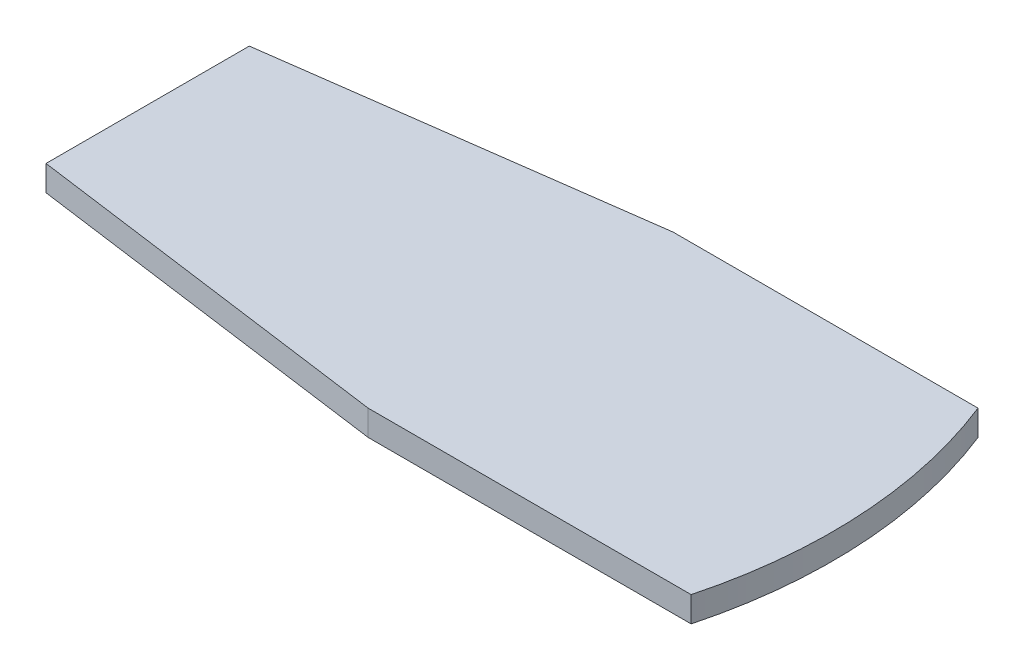
ISO-10303-21;
HEADER;
FILE_DESCRIPTION(('STEP AP214'),'2;1');
FILE_NAME('part.step','',(''),(''),'','','');
FILE_SCHEMA(('AUTOMOTIVE_DESIGN { 1 0 10303 214 1 1 1 1 }'));
ENDSEC;
DATA;
#1=APPLICATION_CONTEXT('core data for automotive mechanical design processes');
#2=APPLICATION_PROTOCOL_DEFINITION('international standard','automotive_design',2000,#1);
#3=PRODUCT_CONTEXT('',#1,'mechanical');
#4=PRODUCT('Part','Part','',(#3));
#5=PRODUCT_RELATED_PRODUCT_CATEGORY('part','',(#4));
#6=PRODUCT_DEFINITION_FORMATION('','',#4);
#7=PRODUCT_DEFINITION_CONTEXT('part definition',#1,'design');
#8=PRODUCT_DEFINITION('design','',#6,#7);
#9=PRODUCT_DEFINITION_SHAPE('','',#8);
#10=(LENGTH_UNIT() NAMED_UNIT(*) SI_UNIT(.MILLI.,.METRE.));
#11=(NAMED_UNIT(*) PLANE_ANGLE_UNIT() SI_UNIT($,.RADIAN.));
#12=(NAMED_UNIT(*) SI_UNIT($,.STERADIAN.) SOLID_ANGLE_UNIT());
#13=UNCERTAINTY_MEASURE_WITH_UNIT(LENGTH_MEASURE(1.E-05),#10,'distance_accuracy_value','');
#14=(GEOMETRIC_REPRESENTATION_CONTEXT(3) GLOBAL_UNCERTAINTY_ASSIGNED_CONTEXT((#13)) GLOBAL_UNIT_ASSIGNED_CONTEXT((#10,
#11,#12)) REPRESENTATION_CONTEXT('',''));
#15=CARTESIAN_POINT('',(0.,0.,0.));
#16=DIRECTION('',(0.,0.,1.));
#17=DIRECTION('',(1.,0.,0.));
#18=AXIS2_PLACEMENT_3D('',#15,#16,#17);
#19=CARTESIAN_POINT('',(-88.9,-3.175,12.7));
#20=DIRECTION('',(-0.135026724539106,0.,0.990841956953903));
#21=DIRECTION('',(0.990841956953903,0.,0.135026724539106));
#22=AXIS2_PLACEMENT_3D('',#19,#20,#21);
#23=PLANE('',#22);
#24=DIRECTION('',(0.990841956953903,0.,0.135026724539106));
#25=VECTOR('',#24,1.);
#26=CARTESIAN_POINT('',(-88.9,0.,12.7));
#27=LINE('',#26,#25);
#28=CARTESIAN_POINT('',(-88.9,0.,12.7));
#29=VERTEX_POINT('',#28);
#30=CARTESIAN_POINT('',(-42.3029545030173,0.,19.05));
#31=VERTEX_POINT('',#30);
#32=EDGE_CURVE('E117',#29,#31,#27,.T.);
#33=ORIENTED_EDGE('',*,*,#32,.F.);
#34=DIRECTION('',(0.,1.,0.));
#35=VECTOR('',#34,1.);
#36=CARTESIAN_POINT('',(-88.9,-3.175,12.7));
#37=LINE('',#36,#35);
#38=CARTESIAN_POINT('',(-88.9,-3.175,12.7));
#39=VERTEX_POINT('',#38);
#40=EDGE_CURVE('E11',#39,#29,#37,.T.);
#41=ORIENTED_EDGE('',*,*,#40,.F.);
#42=DIRECTION('',(0.990841956953903,0.,0.135026724539106));
#43=VECTOR('',#42,1.);
#44=CARTESIAN_POINT('',(-88.9,-3.175,12.7));
#45=LINE('',#44,#43);
#46=CARTESIAN_POINT('',(-42.3029545030173,-3.175,19.05));
#47=VERTEX_POINT('',#46);
#48=EDGE_CURVE('E131',#39,#47,#45,.T.);
#49=ORIENTED_EDGE('',*,*,#48,.T.);
#50=DIRECTION('',(0.,1.,0.));
#51=VECTOR('',#50,1.);
#52=CARTESIAN_POINT('',(-42.3029545030173,-3.175,19.05));
#53=LINE('',#52,#51);
#54=EDGE_CURVE('E35',#47,#31,#53,.T.);
#55=ORIENTED_EDGE('',*,*,#54,.T.);
#56=EDGE_LOOP('',(#33,#41,#49,#55));
#57=FACE_BOUND('',#56,.T.);
#58=ADVANCED_FACE('F32',(#57),#23,.T.);
#59=CARTESIAN_POINT('',(-88.9,-3.175,12.7));
#60=DIRECTION('',(-1.,0.,0.));
#61=DIRECTION('',(0.,0.,1.));
#62=AXIS2_PLACEMENT_3D('',#59,#60,#61);
#63=PLANE('',#62);
#64=DIRECTION('',(0.,0.,1.));
#65=VECTOR('',#64,1.);
#66=CARTESIAN_POINT('',(-88.9,0.,12.7));
#67=LINE('',#66,#65);
#68=CARTESIAN_POINT('',(-88.9,0.,-12.7));
#69=VERTEX_POINT('',#68);
#70=EDGE_CURVE('E129',#69,#29,#67,.T.);
#71=ORIENTED_EDGE('',*,*,#70,.F.);
#72=DIRECTION('',(0.,1.,0.));
#73=VECTOR('',#72,1.);
#74=CARTESIAN_POINT('',(-88.9,-3.175,-12.7));
#75=LINE('',#74,#73);
#76=CARTESIAN_POINT('',(-88.9,-3.175,-12.7));
#77=VERTEX_POINT('',#76);
#78=EDGE_CURVE('E41',#77,#69,#75,.T.);
#79=ORIENTED_EDGE('',*,*,#78,.F.);
#80=DIRECTION('',(0.,0.,1.));
#81=VECTOR('',#80,1.);
#82=CARTESIAN_POINT('',(-88.9,-3.175,12.7));
#83=LINE('',#82,#81);
#84=EDGE_CURVE('E107',#77,#39,#83,.T.);
#85=ORIENTED_EDGE('',*,*,#84,.T.);
#86=ORIENTED_EDGE('',*,*,#40,.T.);
#87=EDGE_LOOP('',(#71,#79,#85,#86));
#88=FACE_BOUND('',#87,.T.);
#89=ADVANCED_FACE('F139',(#88),#63,.T.);
#90=CARTESIAN_POINT('',(-88.9,-3.175,-12.7));
#91=DIRECTION('',(-0.135026724539106,0.,-0.990841956953903));
#92=DIRECTION('',(-0.990841956953903,0.,0.135026724539106));
#93=AXIS2_PLACEMENT_3D('',#90,#91,#92);
#94=PLANE('',#93);
#95=DIRECTION('',(-0.990841956953903,0.,0.135026724539106));
#96=VECTOR('',#95,1.);
#97=CARTESIAN_POINT('',(-88.9,0.,-12.7));
#98=LINE('',#97,#96);
#99=CARTESIAN_POINT('',(-42.3029545030173,0.,-19.05));
#100=VERTEX_POINT('',#99);
#101=EDGE_CURVE('E94',#100,#69,#98,.T.);
#102=ORIENTED_EDGE('',*,*,#101,.F.);
#103=DIRECTION('',(0.,1.,0.));
#104=VECTOR('',#103,1.);
#105=CARTESIAN_POINT('',(-42.3029545030173,-3.175,-19.05));
#106=LINE('',#105,#104);
#107=CARTESIAN_POINT('',(-42.3029545030173,-3.175,-19.05));
#108=VERTEX_POINT('',#107);
#109=EDGE_CURVE('E89',#108,#100,#106,.T.);
#110=ORIENTED_EDGE('',*,*,#109,.F.);
#111=DIRECTION('',(-0.990841956953903,0.,0.135026724539106));
#112=VECTOR('',#111,1.);
#113=CARTESIAN_POINT('',(-88.9,-3.175,-12.7));
#114=LINE('',#113,#112);
#115=EDGE_CURVE('E92',#108,#77,#114,.T.);
#116=ORIENTED_EDGE('',*,*,#115,.T.);
#117=ORIENTED_EDGE('',*,*,#78,.T.);
#118=EDGE_LOOP('',(#102,#110,#116,#117));
#119=FACE_BOUND('',#118,.T.);
#120=ADVANCED_FACE('F91',(#119),#94,.T.);
#121=CARTESIAN_POINT('',(-4.20295450301733,-3.175,-19.05));
#122=DIRECTION('',(0.,0.,-1.));
#123=DIRECTION('',(-1.,0.,0.));
#124=AXIS2_PLACEMENT_3D('',#121,#122,#123);
#125=PLANE('',#124);
#126=DIRECTION('',(-1.,0.,0.));
#127=VECTOR('',#126,1.);
#128=CARTESIAN_POINT('',(-4.20295450301733,0.,-19.05));
#129=LINE('',#128,#127);
#130=CARTESIAN_POINT('',(-4.20295450301733,0.,-19.05));
#131=VERTEX_POINT('',#130);
#132=EDGE_CURVE('E126',#131,#100,#129,.T.);
#133=ORIENTED_EDGE('',*,*,#132,.F.);
#134=DIRECTION('',(0.,1.,0.));
#135=VECTOR('',#134,1.);
#136=CARTESIAN_POINT('',(-4.20295450301733,-3.175,-19.05));
#137=LINE('',#136,#135);
#138=CARTESIAN_POINT('',(-4.20295450301733,-3.175,-19.05));
#139=VERTEX_POINT('',#138);
#140=EDGE_CURVE('E99',#139,#131,#137,.T.);
#141=ORIENTED_EDGE('',*,*,#140,.F.);
#142=DIRECTION('',(-1.,0.,0.));
#143=VECTOR('',#142,1.);
#144=CARTESIAN_POINT('',(-4.20295450301733,-3.175,-19.05));
#145=LINE('',#144,#143);
#146=EDGE_CURVE('E105',#139,#108,#145,.T.);
#147=ORIENTED_EDGE('',*,*,#146,.T.);
#148=ORIENTED_EDGE('',*,*,#109,.T.);
#149=EDGE_LOOP('',(#133,#141,#147,#148));
#150=FACE_BOUND('',#149,.T.);
#151=ADVANCED_FACE('F109',(#150),#125,.T.);
#152=CARTESIAN_POINT('',(-60.7677146415035,-3.175,3.41838722379855));
#153=DIRECTION('',(0.,1.,0.));
#154=DIRECTION('',(0.,0.,1.));
#155=AXIS2_PLACEMENT_3D('',#152,#153,#154);
#156=CYLINDRICAL_SURFACE('',#155,60.8637865562357);
#157=CARTESIAN_POINT('',(-60.7677146415035,0.,3.41838722379855));
#158=DIRECTION('',(0.,1.,0.));
#159=DIRECTION('',(0.,0.,-1.));
#160=AXIS2_PLACEMENT_3D('',#157,#158,#159);
#161=CIRCLE('',#160,60.8637865562357);
#162=CARTESIAN_POINT('',(-1.9454977844526,0.,19.05));
#163=VERTEX_POINT('',#162);
#164=EDGE_CURVE('E123',#163,#131,#161,.T.);
#165=ORIENTED_EDGE('',*,*,#164,.F.);
#166=DIRECTION('',(0.,1.,0.));
#167=VECTOR('',#166,1.);
#168=CARTESIAN_POINT('',(-1.9454977844526,-3.175,19.05));
#169=LINE('',#168,#167);
#170=CARTESIAN_POINT('',(-1.9454977844526,-3.175,19.05));
#171=VERTEX_POINT('',#170);
#172=EDGE_CURVE('E134',#171,#163,#169,.T.);
#173=ORIENTED_EDGE('',*,*,#172,.F.);
#174=CARTESIAN_POINT('',(-60.7677146415035,-3.175,3.41838722379855));
#175=DIRECTION('',(0.,1.,0.));
#176=DIRECTION('',(0.,0.,-1.));
#177=AXIS2_PLACEMENT_3D('',#174,#175,#176);
#178=CIRCLE('',#177,60.8637865562357);
#179=EDGE_CURVE('E110',#171,#139,#178,.T.);
#180=ORIENTED_EDGE('',*,*,#179,.T.);
#181=ORIENTED_EDGE('',*,*,#140,.T.);
#182=EDGE_LOOP('',(#165,#173,#180,#181));
#183=FACE_BOUND('',#182,.T.);
#184=ADVANCED_FACE('F152',(#183),#156,.T.);
#185=CARTESIAN_POINT('',(-1.94549778445261,-3.175,19.05));
#186=DIRECTION('',(0.,0.,1.));
#187=DIRECTION('',(1.,0.,0.));
#188=AXIS2_PLACEMENT_3D('',#185,#186,#187);
#189=PLANE('',#188);
#190=DIRECTION('',(1.,0.,0.));
#191=VECTOR('',#190,1.);
#192=CARTESIAN_POINT('',(-1.94549778445261,0.,19.05));
#193=LINE('',#192,#191);
#194=EDGE_CURVE('E120',#31,#163,#193,.T.);
#195=ORIENTED_EDGE('',*,*,#194,.F.);
#196=ORIENTED_EDGE('',*,*,#54,.F.);
#197=DIRECTION('',(1.,0.,0.));
#198=VECTOR('',#197,1.);
#199=CARTESIAN_POINT('',(-1.94549778445261,-3.175,19.05));
#200=LINE('',#199,#198);
#201=EDGE_CURVE('E112',#47,#171,#200,.T.);
#202=ORIENTED_EDGE('',*,*,#201,.T.);
#203=ORIENTED_EDGE('',*,*,#172,.T.);
#204=EDGE_LOOP('',(#195,#196,#202,#203));
#205=FACE_BOUND('',#204,.T.);
#206=ADVANCED_FACE('F136',(#205),#189,.T.);
#207=CARTESIAN_POINT('',(-60.7677146415035,-3.175,3.41838722379855));
#208=DIRECTION('',(0.,-1.,0.));
#209=DIRECTION('',(0.,0.,-1.));
#210=AXIS2_PLACEMENT_3D('',#207,#208,#209);
#211=PLANE('',#210);
#212=ORIENTED_EDGE('',*,*,#48,.F.);
#213=ORIENTED_EDGE('',*,*,#84,.F.);
#214=ORIENTED_EDGE('',*,*,#115,.F.);
#215=ORIENTED_EDGE('',*,*,#146,.F.);
#216=ORIENTED_EDGE('',*,*,#179,.F.);
#217=ORIENTED_EDGE('',*,*,#201,.F.);
#218=EDGE_LOOP('',(#212,#213,#214,#215,#216,#217));
#219=FACE_BOUND('',#218,.T.);
#220=ADVANCED_FACE('F103',(#219),#211,.T.);
#221=CARTESIAN_POINT('',(-60.7677146415035,0.,3.41838722379855));
#222=DIRECTION('',(0.,-1.,0.));
#223=DIRECTION('',(0.,0.,-1.));
#224=AXIS2_PLACEMENT_3D('',#221,#222,#223);
#225=PLANE('',#224);
#226=ORIENTED_EDGE('',*,*,#32,.T.);
#227=ORIENTED_EDGE('',*,*,#194,.T.);
#228=ORIENTED_EDGE('',*,*,#164,.T.);
#229=ORIENTED_EDGE('',*,*,#132,.T.);
#230=ORIENTED_EDGE('',*,*,#101,.T.);
#231=ORIENTED_EDGE('',*,*,#70,.T.);
#232=EDGE_LOOP('',(#226,#227,#228,#229,#230,#231));
#233=FACE_BOUND('',#232,.T.);
#234=ADVANCED_FACE('F138',(#233),#225,.F.);
#235=CLOSED_SHELL('',(#58,#89,#120,#151,#184,#206,#220,#234));
#236=MANIFOLD_SOLID_BREP('B2',#235);
#237=ADVANCED_BREP_SHAPE_REPRESENTATION('',(#18,#236),#14);
#238=SHAPE_DEFINITION_REPRESENTATION(#9,#237);
ENDSEC;
END-ISO-10303-21;
